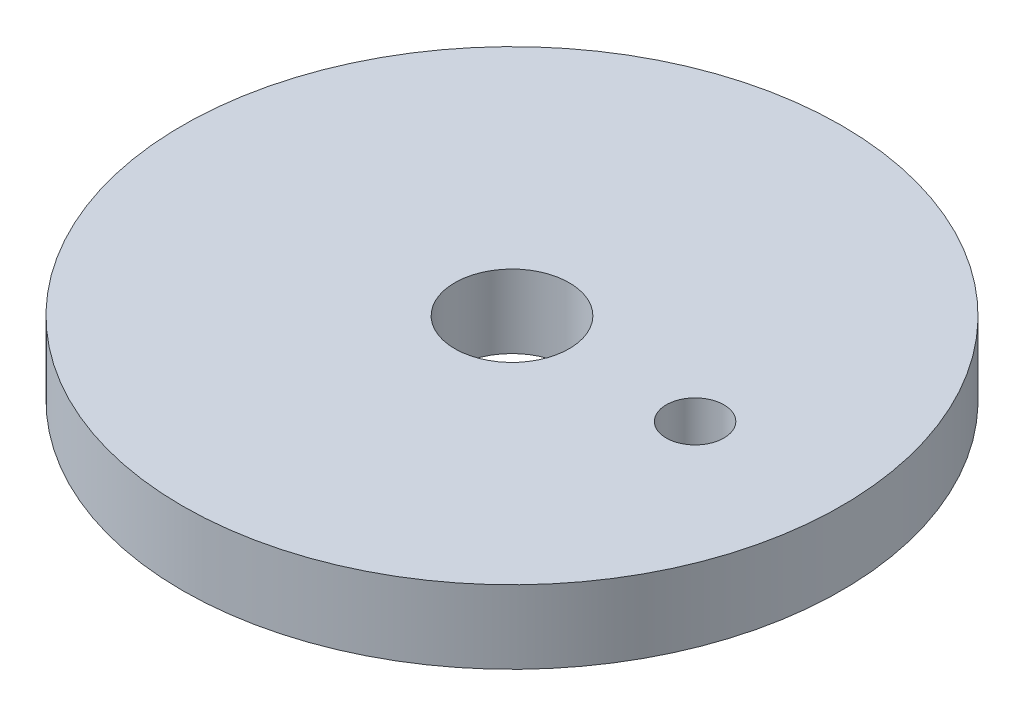
ISO-10303-21;
HEADER;
FILE_DESCRIPTION(('STEP AP214'),'2;1');
FILE_NAME('part.step','',(''),(''),'','','');
FILE_SCHEMA(('AUTOMOTIVE_DESIGN { 1 0 10303 214 1 1 1 1 }'));
ENDSEC;
DATA;
#1=APPLICATION_CONTEXT('core data for automotive mechanical design processes');
#2=APPLICATION_PROTOCOL_DEFINITION('international standard','automotive_design',2000,#1);
#3=PRODUCT_CONTEXT('',#1,'mechanical');
#4=PRODUCT('Part','Part','',(#3));
#5=PRODUCT_RELATED_PRODUCT_CATEGORY('part','',(#4));
#6=PRODUCT_DEFINITION_FORMATION('','',#4);
#7=PRODUCT_DEFINITION_CONTEXT('part definition',#1,'design');
#8=PRODUCT_DEFINITION('design','',#6,#7);
#9=PRODUCT_DEFINITION_SHAPE('','',#8);
#10=(LENGTH_UNIT() NAMED_UNIT(*) SI_UNIT(.MILLI.,.METRE.));
#11=(NAMED_UNIT(*) PLANE_ANGLE_UNIT() SI_UNIT($,.RADIAN.));
#12=(NAMED_UNIT(*) SI_UNIT($,.STERADIAN.) SOLID_ANGLE_UNIT());
#13=UNCERTAINTY_MEASURE_WITH_UNIT(LENGTH_MEASURE(1.E-05),#10,'distance_accuracy_value','');
#14=(GEOMETRIC_REPRESENTATION_CONTEXT(3) GLOBAL_UNCERTAINTY_ASSIGNED_CONTEXT((#13)) GLOBAL_UNIT_ASSIGNED_CONTEXT((#10,
#11,#12)) REPRESENTATION_CONTEXT('',''));
#15=CARTESIAN_POINT('',(0.,0.,0.));
#16=DIRECTION('',(0.,0.,1.));
#17=DIRECTION('',(1.,0.,0.));
#18=AXIS2_PLACEMENT_3D('',#15,#16,#17);
#19=CARTESIAN_POINT('',(0.,5.08,0.));
#20=DIRECTION('',(0.,1.,0.));
#21=DIRECTION('',(0.,0.,1.));
#22=AXIS2_PLACEMENT_3D('',#19,#20,#21);
#23=PLANE('',#22);
#24=CARTESIAN_POINT('',(0.,5.08,0.));
#25=DIRECTION('',(0.,1.,0.));
#26=DIRECTION('',(0.,0.,1.));
#27=AXIS2_PLACEMENT_3D('',#24,#25,#26);
#28=CIRCLE('',#27,3.96875);
#29=CARTESIAN_POINT('',(0.,5.08,3.96875));
#30=VERTEX_POINT('',#29);
#31=EDGE_CURVE('E42',#30,#30,#28,.T.);
#32=ORIENTED_EDGE('',*,*,#31,.F.);
#33=EDGE_LOOP('',(#32));
#34=FACE_BOUND('',#33,.T.);
#35=CARTESIAN_POINT('',(0.,5.08,0.));
#36=DIRECTION('',(0.,1.,0.));
#37=DIRECTION('',(0.,0.,1.));
#38=AXIS2_PLACEMENT_3D('',#35,#36,#37);
#39=CIRCLE('',#38,22.86);
#40=CARTESIAN_POINT('',(0.,5.08,22.86));
#41=VERTEX_POINT('',#40);
#42=EDGE_CURVE('E10',#41,#41,#39,.T.);
#43=ORIENTED_EDGE('',*,*,#42,.T.);
#44=EDGE_LOOP('',(#43));
#45=FACE_BOUND('',#44,.T.);
#46=CARTESIAN_POINT('',(12.7,5.08,0.));
#47=DIRECTION('',(0.,1.,0.));
#48=DIRECTION('',(0.,0.,1.));
#49=AXIS2_PLACEMENT_3D('',#46,#47,#48);
#50=CIRCLE('',#49,2.);
#51=CARTESIAN_POINT('',(12.7,5.08,2.));
#52=VERTEX_POINT('',#51);
#53=EDGE_CURVE('E47',#52,#52,#50,.T.);
#54=ORIENTED_EDGE('',*,*,#53,.F.);
#55=EDGE_LOOP('',(#54));
#56=FACE_BOUND('',#55,.T.);
#57=ADVANCED_FACE('F31',(#34,#45,#56),#23,.T.);
#58=CARTESIAN_POINT('',(0.,0.,0.));
#59=DIRECTION('',(0.,1.,0.));
#60=DIRECTION('',(0.,0.,1.));
#61=AXIS2_PLACEMENT_3D('',#58,#59,#60);
#62=PLANE('',#61);
#63=CARTESIAN_POINT('',(0.,0.,0.));
#64=DIRECTION('',(0.,1.,0.));
#65=DIRECTION('',(0.,0.,1.));
#66=AXIS2_PLACEMENT_3D('',#63,#64,#65);
#67=CIRCLE('',#66,3.96875);
#68=CARTESIAN_POINT('',(0.,0.,3.96875));
#69=VERTEX_POINT('',#68);
#70=EDGE_CURVE('E44',#69,#69,#67,.T.);
#71=ORIENTED_EDGE('',*,*,#70,.T.);
#72=EDGE_LOOP('',(#71));
#73=FACE_BOUND('',#72,.T.);
#74=CARTESIAN_POINT('',(0.,0.,0.));
#75=DIRECTION('',(0.,1.,0.));
#76=DIRECTION('',(0.,0.,1.));
#77=AXIS2_PLACEMENT_3D('',#74,#75,#76);
#78=CIRCLE('',#77,22.86);
#79=CARTESIAN_POINT('',(0.,0.,22.86));
#80=VERTEX_POINT('',#79);
#81=EDGE_CURVE('E35',#80,#80,#78,.T.);
#82=ORIENTED_EDGE('',*,*,#81,.F.);
#83=EDGE_LOOP('',(#82));
#84=FACE_BOUND('',#83,.T.);
#85=CARTESIAN_POINT('',(12.7,0.,0.));
#86=DIRECTION('',(0.,1.,0.));
#87=DIRECTION('',(0.,0.,1.));
#88=AXIS2_PLACEMENT_3D('',#85,#86,#87);
#89=CIRCLE('',#88,2.);
#90=CARTESIAN_POINT('',(12.7,0.,2.));
#91=VERTEX_POINT('',#90);
#92=EDGE_CURVE('E50',#91,#91,#89,.T.);
#93=ORIENTED_EDGE('',*,*,#92,.T.);
#94=EDGE_LOOP('',(#93));
#95=FACE_BOUND('',#94,.T.);
#96=ADVANCED_FACE('F60',(#73,#84,#95),#62,.F.);
#97=CARTESIAN_POINT('',(0.,5.08,0.));
#98=DIRECTION('',(0.,-1.,0.));
#99=DIRECTION('',(0.,0.,-1.));
#100=AXIS2_PLACEMENT_3D('',#97,#98,#99);
#101=CYLINDRICAL_SURFACE('',#100,22.86);
#102=ORIENTED_EDGE('',*,*,#42,.F.);
#103=EDGE_LOOP('',(#102));
#104=FACE_BOUND('',#103,.T.);
#105=ORIENTED_EDGE('',*,*,#81,.T.);
#106=EDGE_LOOP('',(#105));
#107=FACE_BOUND('',#106,.T.);
#108=ADVANCED_FACE('F33',(#104,#107),#101,.T.);
#109=CARTESIAN_POINT('',(0.,5.08,0.));
#110=DIRECTION('',(0.,-1.,0.));
#111=DIRECTION('',(0.,0.,-1.));
#112=AXIS2_PLACEMENT_3D('',#109,#110,#111);
#113=CYLINDRICAL_SURFACE('',#112,3.96875);
#114=ORIENTED_EDGE('',*,*,#31,.T.);
#115=EDGE_LOOP('',(#114));
#116=FACE_BOUND('',#115,.T.);
#117=ORIENTED_EDGE('',*,*,#70,.F.);
#118=EDGE_LOOP('',(#117));
#119=FACE_BOUND('',#118,.T.);
#120=ADVANCED_FACE('F69',(#116,#119),#113,.F.);
#121=CARTESIAN_POINT('',(12.7,5.08,0.));
#122=DIRECTION('',(0.,-1.,0.));
#123=DIRECTION('',(0.,0.,-1.));
#124=AXIS2_PLACEMENT_3D('',#121,#122,#123);
#125=CYLINDRICAL_SURFACE('',#124,2.);
#126=ORIENTED_EDGE('',*,*,#53,.T.);
#127=EDGE_LOOP('',(#126));
#128=FACE_BOUND('',#127,.T.);
#129=ORIENTED_EDGE('',*,*,#92,.F.);
#130=EDGE_LOOP('',(#129));
#131=FACE_BOUND('',#130,.T.);
#132=ADVANCED_FACE('F56',(#128,#131),#125,.F.);
#133=CLOSED_SHELL('',(#57,#96,#108,#120,#132));
#134=MANIFOLD_SOLID_BREP('B2',#133);
#135=ADVANCED_BREP_SHAPE_REPRESENTATION('',(#18,#134),#14);
#136=SHAPE_DEFINITION_REPRESENTATION(#9,#135);
ENDSEC;
END-ISO-10303-21;
